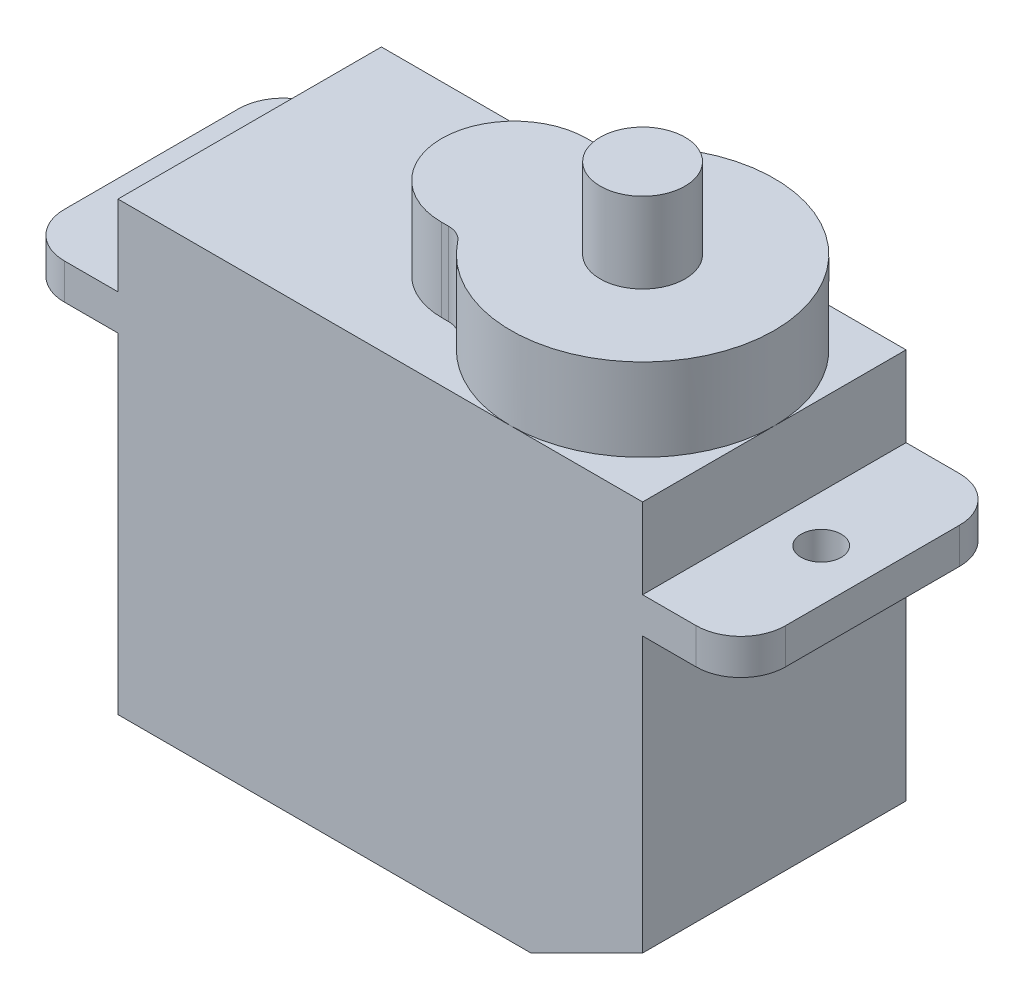
ISO-10303-21;
HEADER;
FILE_DESCRIPTION(('STEP AP214'),'2;1');
FILE_NAME('part.step','',(''),(''),'','','');
FILE_SCHEMA(('AUTOMOTIVE_DESIGN { 1 0 10303 214 1 1 1 1 }'));
ENDSEC;
DATA;
#1=APPLICATION_CONTEXT('core data for automotive mechanical design processes');
#2=APPLICATION_PROTOCOL_DEFINITION('international standard','automotive_design',2000,#1);
#3=PRODUCT_CONTEXT('',#1,'mechanical');
#4=PRODUCT('Part','Part','',(#3));
#5=PRODUCT_RELATED_PRODUCT_CATEGORY('part','',(#4));
#6=PRODUCT_DEFINITION_FORMATION('','',#4);
#7=PRODUCT_DEFINITION_CONTEXT('part definition',#1,'design');
#8=PRODUCT_DEFINITION('design','',#6,#7);
#9=PRODUCT_DEFINITION_SHAPE('','',#8);
#10=(LENGTH_UNIT() NAMED_UNIT(*) SI_UNIT(.MILLI.,.METRE.));
#11=(NAMED_UNIT(*) PLANE_ANGLE_UNIT() SI_UNIT($,.RADIAN.));
#12=(NAMED_UNIT(*) SI_UNIT($,.STERADIAN.) SOLID_ANGLE_UNIT());
#13=UNCERTAINTY_MEASURE_WITH_UNIT(LENGTH_MEASURE(1.E-05),#10,'distance_accuracy_value','');
#14=(GEOMETRIC_REPRESENTATION_CONTEXT(3) GLOBAL_UNCERTAINTY_ASSIGNED_CONTEXT((#13)) GLOBAL_UNIT_ASSIGNED_CONTEXT((#10,
#11,#12)) REPRESENTATION_CONTEXT('',''));
#15=CARTESIAN_POINT('',(0.,0.,0.));
#16=DIRECTION('',(0.,0.,1.));
#17=DIRECTION('',(1.,0.,0.));
#18=AXIS2_PLACEMENT_3D('',#15,#16,#17);
#19=CARTESIAN_POINT('',(0.,20.,11.8));
#20=DIRECTION('',(0.,1.,0.));
#21=DIRECTION('',(0.,0.,1.));
#22=AXIS2_PLACEMENT_3D('',#19,#20,#21);
#23=PLANE('',#22);
#24=CARTESIAN_POINT('',(12.1642387837581,20.,10.15));
#25=DIRECTION('',(0.,-1.,0.));
#26=DIRECTION('',(0.,0.,1.));
#27=AXIS2_PLACEMENT_3D('',#24,#25,#26);
#28=CIRCLE('',#27,1.);
#29=CARTESIAN_POINT('',(12.1642387837581,20.,9.15));
#30=VERTEX_POINT('',#29);
#31=CARTESIAN_POINT('',(12.9520302643728,20.,9.53405797101449));
#32=VERTEX_POINT('',#31);
#33=EDGE_CURVE('E52',#30,#32,#28,.T.);
#34=ORIENTED_EDGE('',*,*,#33,.F.);
#35=DIRECTION('',(1.,0.,0.));
#36=VECTOR('',#35,1.);
#37=CARTESIAN_POINT('',(11.85,20.,9.15));
#38=LINE('',#37,#36);
#39=CARTESIAN_POINT('',(11.85,20.,9.15));
#40=VERTEX_POINT('',#39);
#41=EDGE_CURVE('E56',#40,#30,#38,.T.);
#42=ORIENTED_EDGE('',*,*,#41,.F.);
#43=CARTESIAN_POINT('',(11.85,20.,5.9));
#44=DIRECTION('',(0.,1.,0.));
#45=DIRECTION('',(0.,0.,1.));
#46=AXIS2_PLACEMENT_3D('',#43,#44,#45);
#47=CIRCLE('',#46,3.25);
#48=CARTESIAN_POINT('',(11.85,20.,2.65));
#49=VERTEX_POINT('',#48);
#50=EDGE_CURVE('E743',#49,#40,#47,.T.);
#51=ORIENTED_EDGE('',*,*,#50,.F.);
#52=DIRECTION('',(-1.,0.,0.));
#53=VECTOR('',#52,1.);
#54=CARTESIAN_POINT('',(11.85,20.,2.65));
#55=LINE('',#54,#53);
#56=CARTESIAN_POINT('',(12.1642387837581,20.,2.65));
#57=VERTEX_POINT('',#56);
#58=EDGE_CURVE('E380',#57,#49,#55,.T.);
#59=ORIENTED_EDGE('',*,*,#58,.F.);
#60=CARTESIAN_POINT('',(12.1642387837581,20.,1.65));
#61=DIRECTION('',(0.,-1.,0.));
#62=DIRECTION('',(0.,0.,-1.));
#63=AXIS2_PLACEMENT_3D('',#60,#61,#62);
#64=CIRCLE('',#63,0.999999999999999);
#65=CARTESIAN_POINT('',(12.9520302643728,20.,2.26594202898551));
#66=VERTEX_POINT('',#65);
#67=EDGE_CURVE('E378',#66,#57,#64,.T.);
#68=ORIENTED_EDGE('',*,*,#67,.F.);
#69=CARTESIAN_POINT('',(17.6,20.,5.9));
#70=DIRECTION('',(0.,1.,0.));
#71=DIRECTION('',(0.,0.,1.));
#72=AXIS2_PLACEMENT_3D('',#69,#70,#71);
#73=CIRCLE('',#72,5.9);
#74=CARTESIAN_POINT('',(17.6,20.,0.));
#75=VERTEX_POINT('',#74);
#76=EDGE_CURVE('E372',#75,#66,#73,.T.);
#77=ORIENTED_EDGE('',*,*,#76,.F.);
#78=DIRECTION('',(1.,0.,0.));
#79=VECTOR('',#78,1.);
#80=CARTESIAN_POINT('',(0.,20.,0.));
#81=LINE('',#80,#79);
#82=CARTESIAN_POINT('',(0.,20.,0.));
#83=VERTEX_POINT('',#82);
#84=EDGE_CURVE('E277',#83,#75,#81,.T.);
#85=ORIENTED_EDGE('',*,*,#84,.F.);
#86=DIRECTION('',(0.,0.,-1.));
#87=VECTOR('',#86,1.);
#88=CARTESIAN_POINT('',(0.,20.,11.8));
#89=LINE('',#88,#87);
#90=CARTESIAN_POINT('',(0.,20.,11.8));
#91=VERTEX_POINT('',#90);
#92=EDGE_CURVE('E332',#91,#83,#89,.T.);
#93=ORIENTED_EDGE('',*,*,#92,.F.);
#94=DIRECTION('',(1.,0.,0.));
#95=VECTOR('',#94,1.);
#96=CARTESIAN_POINT('',(0.,20.,11.8));
#97=LINE('',#96,#95);
#98=CARTESIAN_POINT('',(17.6,20.,11.8));
#99=VERTEX_POINT('',#98);
#100=EDGE_CURVE('E244',#91,#99,#97,.T.);
#101=ORIENTED_EDGE('',*,*,#100,.T.);
#102=EDGE_CURVE('E45',#32,#99,#73,.T.);
#103=ORIENTED_EDGE('',*,*,#102,.F.);
#104=EDGE_LOOP('',(#34,#42,#51,#59,#68,#77,#85,#93,#101,#103));
#105=FACE_BOUND('',#104,.T.);
#106=ADVANCED_FACE('F34',(#105),#23,.T.);
#107=CARTESIAN_POINT('',(23.5,20.,5.9));
#108=VERTEX_POINT('',#107);
#109=EDGE_CURVE('E11',#99,#108,#73,.T.);
#110=ORIENTED_EDGE('',*,*,#109,.F.);
#111=CARTESIAN_POINT('',(23.5,20.,11.8));
#112=VERTEX_POINT('',#111);
#113=EDGE_CURVE('E243',#99,#112,#97,.T.);
#114=ORIENTED_EDGE('',*,*,#113,.T.);
#115=DIRECTION('',(0.,0.,-1.));
#116=VECTOR('',#115,1.);
#117=CARTESIAN_POINT('',(23.5,20.,11.8));
#118=LINE('',#117,#116);
#119=EDGE_CURVE('E328',#112,#108,#118,.T.);
#120=ORIENTED_EDGE('',*,*,#119,.T.);
#121=EDGE_LOOP('',(#110,#114,#120));
#122=FACE_BOUND('',#121,.T.);
#123=ADVANCED_FACE('F412',(#122),#23,.T.);
#124=CARTESIAN_POINT('',(-4.4,16.4,11.8));
#125=DIRECTION('',(0.,1.,0.));
#126=DIRECTION('',(0.,0.,1.));
#127=AXIS2_PLACEMENT_3D('',#124,#125,#126);
#128=PLANE('',#127);
#129=CARTESIAN_POINT('',(-2.1,16.4,5.9));
#130=DIRECTION('',(0.,1.,0.));
#131=DIRECTION('',(-1.,0.,0.));
#132=AXIS2_PLACEMENT_3D('',#129,#130,#131);
#133=CIRCLE('',#132,0.9);
#134=CARTESIAN_POINT('',(-3.,16.4,5.9));
#135=VERTEX_POINT('',#134);
#136=EDGE_CURVE('E233',#135,#135,#133,.T.);
#137=ORIENTED_EDGE('',*,*,#136,.F.);
#138=EDGE_LOOP('',(#137));
#139=FACE_BOUND('',#138,.T.);
#140=DIRECTION('',(0.,0.,-1.));
#141=VECTOR('',#140,1.);
#142=CARTESIAN_POINT('',(-4.4,16.4,11.8));
#143=LINE('',#142,#141);
#144=CARTESIAN_POINT('',(-4.4,16.4,9.8));
#145=VERTEX_POINT('',#144);
#146=CARTESIAN_POINT('',(-4.4,16.4,2.));
#147=VERTEX_POINT('',#146);
#148=EDGE_CURVE('E302',#145,#147,#143,.T.);
#149=ORIENTED_EDGE('',*,*,#148,.F.);
#150=CARTESIAN_POINT('',(-2.4,16.4,9.8));
#151=DIRECTION('',(0.,1.,0.));
#152=DIRECTION('',(0.,0.,1.));
#153=AXIS2_PLACEMENT_3D('',#150,#151,#152);
#154=CIRCLE('',#153,2.);
#155=CARTESIAN_POINT('',(-2.4,16.4,11.8));
#156=VERTEX_POINT('',#155);
#157=EDGE_CURVE('E367',#145,#156,#154,.T.);
#158=ORIENTED_EDGE('',*,*,#157,.T.);
#159=DIRECTION('',(1.,0.,0.));
#160=VECTOR('',#159,1.);
#161=CARTESIAN_POINT('',(-4.4,16.4,11.8));
#162=LINE('',#161,#160);
#163=CARTESIAN_POINT('',(0.,16.4,11.8));
#164=VERTEX_POINT('',#163);
#165=EDGE_CURVE('E237',#156,#164,#162,.T.);
#166=ORIENTED_EDGE('',*,*,#165,.T.);
#167=DIRECTION('',(0.,0.,-1.));
#168=VECTOR('',#167,1.);
#169=CARTESIAN_POINT('',(0.,16.4,11.8));
#170=LINE('',#169,#168);
#171=CARTESIAN_POINT('',(0.,16.4,0.));
#172=VERTEX_POINT('',#171);
#173=EDGE_CURVE('E270',#164,#172,#170,.T.);
#174=ORIENTED_EDGE('',*,*,#173,.T.);
#175=DIRECTION('',(1.,0.,0.));
#176=VECTOR('',#175,1.);
#177=CARTESIAN_POINT('',(-4.4,16.4,0.));
#178=LINE('',#177,#176);
#179=CARTESIAN_POINT('',(-2.4,16.4,0.));
#180=VERTEX_POINT('',#179);
#181=EDGE_CURVE('E271',#180,#172,#178,.T.);
#182=ORIENTED_EDGE('',*,*,#181,.F.);
#183=CARTESIAN_POINT('',(-2.4,16.4,2.));
#184=DIRECTION('',(0.,1.,0.));
#185=DIRECTION('',(0.,0.,1.));
#186=AXIS2_PLACEMENT_3D('',#183,#184,#185);
#187=CIRCLE('',#186,2.);
#188=EDGE_CURVE('E365',#180,#147,#187,.T.);
#189=ORIENTED_EDGE('',*,*,#188,.T.);
#190=EDGE_LOOP('',(#149,#158,#166,#174,#182,#189));
#191=FACE_BOUND('',#190,.T.);
#192=ADVANCED_FACE('F418',(#139,#191),#128,.T.);
#193=CARTESIAN_POINT('',(-4.4,14.8,11.8));
#194=DIRECTION('',(-1.,0.,0.));
#195=DIRECTION('',(0.,0.,1.));
#196=AXIS2_PLACEMENT_3D('',#193,#194,#195);
#197=PLANE('',#196);
#198=DIRECTION('',(0.,0.,-1.));
#199=VECTOR('',#198,1.);
#200=CARTESIAN_POINT('',(-4.4,14.8,11.8));
#201=LINE('',#200,#199);
#202=CARTESIAN_POINT('',(-4.4,14.8,9.8));
#203=VERTEX_POINT('',#202);
#204=CARTESIAN_POINT('',(-4.4,14.8,2.));
#205=VERTEX_POINT('',#204);
#206=EDGE_CURVE('E306',#203,#205,#201,.T.);
#207=ORIENTED_EDGE('',*,*,#206,.F.);
#208=DIRECTION('',(0.,1.,0.));
#209=VECTOR('',#208,1.);
#210=CARTESIAN_POINT('',(-4.4,14.8,9.8));
#211=LINE('',#210,#209);
#212=EDGE_CURVE('E362',#203,#145,#211,.T.);
#213=ORIENTED_EDGE('',*,*,#212,.T.);
#214=ORIENTED_EDGE('',*,*,#148,.T.);
#215=DIRECTION('',(0.,1.,0.));
#216=VECTOR('',#215,1.);
#217=CARTESIAN_POINT('',(-4.4,14.8,2.));
#218=LINE('',#217,#216);
#219=EDGE_CURVE('E360',#147,#205,#218,.F.);
#220=ORIENTED_EDGE('',*,*,#219,.T.);
#221=EDGE_LOOP('',(#207,#213,#214,#220));
#222=FACE_BOUND('',#221,.T.);
#223=ADVANCED_FACE('F458',(#222),#197,.T.);
#224=CARTESIAN_POINT('',(0.,14.8,11.8));
#225=DIRECTION('',(0.,-1.,0.));
#226=DIRECTION('',(0.,0.,-1.));
#227=AXIS2_PLACEMENT_3D('',#224,#225,#226);
#228=PLANE('',#227);
#229=CARTESIAN_POINT('',(-2.1,14.8,5.9));
#230=DIRECTION('',(0.,-1.,0.));
#231=DIRECTION('',(0.,0.,-1.));
#232=AXIS2_PLACEMENT_3D('',#229,#230,#231);
#233=CIRCLE('',#232,0.9);
#234=CARTESIAN_POINT('',(-2.1,14.8,5.00000000000001));
#235=VERTEX_POINT('',#234);
#236=EDGE_CURVE('E236',#235,#235,#233,.T.);
#237=ORIENTED_EDGE('',*,*,#236,.F.);
#238=EDGE_LOOP('',(#237));
#239=FACE_BOUND('',#238,.T.);
#240=DIRECTION('',(-1.,0.,0.));
#241=VECTOR('',#240,1.);
#242=CARTESIAN_POINT('',(0.,14.8,11.8));
#243=LINE('',#242,#241);
#244=CARTESIAN_POINT('',(0.,14.8,11.8));
#245=VERTEX_POINT('',#244);
#246=CARTESIAN_POINT('',(-2.4,14.8,11.8));
#247=VERTEX_POINT('',#246);
#248=EDGE_CURVE('E267',#245,#247,#243,.T.);
#249=ORIENTED_EDGE('',*,*,#248,.T.);
#250=CARTESIAN_POINT('',(-2.4,14.8,9.8));
#251=DIRECTION('',(0.,-1.,0.));
#252=DIRECTION('',(0.,0.,-1.));
#253=AXIS2_PLACEMENT_3D('',#250,#251,#252);
#254=CIRCLE('',#253,2.);
#255=EDGE_CURVE('E38',#247,#203,#254,.T.);
#256=ORIENTED_EDGE('',*,*,#255,.T.);
#257=ORIENTED_EDGE('',*,*,#206,.T.);
#258=CARTESIAN_POINT('',(-2.4,14.8,2.));
#259=DIRECTION('',(0.,-1.,0.));
#260=DIRECTION('',(0.,0.,-1.));
#261=AXIS2_PLACEMENT_3D('',#258,#259,#260);
#262=CIRCLE('',#261,2.);
#263=CARTESIAN_POINT('',(-2.4,14.8,0.));
#264=VERTEX_POINT('',#263);
#265=EDGE_CURVE('E368',#205,#264,#262,.T.);
#266=ORIENTED_EDGE('',*,*,#265,.T.);
#267=DIRECTION('',(-1.,0.,0.));
#268=VECTOR('',#267,1.);
#269=CARTESIAN_POINT('',(0.,14.8,0.));
#270=LINE('',#269,#268);
#271=CARTESIAN_POINT('',(0.,14.8,0.));
#272=VERTEX_POINT('',#271);
#273=EDGE_CURVE('E240',#272,#264,#270,.T.);
#274=ORIENTED_EDGE('',*,*,#273,.F.);
#275=DIRECTION('',(0.,0.,-1.));
#276=VECTOR('',#275,1.);
#277=CARTESIAN_POINT('',(0.,14.8,11.8));
#278=LINE('',#277,#276);
#279=EDGE_CURVE('E309',#245,#272,#278,.T.);
#280=ORIENTED_EDGE('',*,*,#279,.F.);
#281=EDGE_LOOP('',(#249,#256,#257,#266,#274,#280));
#282=FACE_BOUND('',#281,.T.);
#283=ADVANCED_FACE('F466',(#239,#282),#228,.T.);
#284=CARTESIAN_POINT('',(0.,0.,11.8));
#285=DIRECTION('',(-1.,0.,0.));
#286=DIRECTION('',(0.,0.,1.));
#287=AXIS2_PLACEMENT_3D('',#284,#285,#286);
#288=PLANE('',#287);
#289=DIRECTION('',(0.,1.,0.));
#290=VECTOR('',#289,1.);
#291=CARTESIAN_POINT('',(0.,0.,0.));
#292=LINE('',#291,#290);
#293=CARTESIAN_POINT('',(0.,0.,0.));
#294=VERTEX_POINT('',#293);
#295=EDGE_CURVE('E297',#294,#272,#292,.T.);
#296=ORIENTED_EDGE('',*,*,#295,.F.);
#297=DIRECTION('',(0.,0.,-1.));
#298=VECTOR('',#297,1.);
#299=CARTESIAN_POINT('',(0.,0.,11.8));
#300=LINE('',#299,#298);
#301=CARTESIAN_POINT('',(0.,0.,11.8));
#302=VERTEX_POINT('',#301);
#303=EDGE_CURVE('E311',#302,#294,#300,.T.);
#304=ORIENTED_EDGE('',*,*,#303,.F.);
#305=DIRECTION('',(0.,1.,0.));
#306=VECTOR('',#305,1.);
#307=CARTESIAN_POINT('',(0.,0.,11.8));
#308=LINE('',#307,#306);
#309=EDGE_CURVE('E264',#302,#245,#308,.T.);
#310=ORIENTED_EDGE('',*,*,#309,.T.);
#311=ORIENTED_EDGE('',*,*,#279,.T.);
#312=EDGE_LOOP('',(#296,#304,#310,#311));
#313=FACE_BOUND('',#312,.T.);
#314=ADVANCED_FACE('F470',(#313),#288,.T.);
#315=CARTESIAN_POINT('',(18.5,0.,11.8));
#316=DIRECTION('',(0.,-1.,0.));
#317=DIRECTION('',(0.,0.,-1.));
#318=AXIS2_PLACEMENT_3D('',#315,#316,#317);
#319=PLANE('',#318);
#320=DIRECTION('',(-1.,0.,0.));
#321=VECTOR('',#320,1.);
#322=CARTESIAN_POINT('',(18.5,0.,0.));
#323=LINE('',#322,#321);
#324=CARTESIAN_POINT('',(18.5,0.,0.));
#325=VERTEX_POINT('',#324);
#326=EDGE_CURVE('E294',#325,#294,#323,.T.);
#327=ORIENTED_EDGE('',*,*,#326,.F.);
#328=DIRECTION('',(0.,0.,-1.));
#329=VECTOR('',#328,1.);
#330=CARTESIAN_POINT('',(18.5,0.,11.8));
#331=LINE('',#330,#329);
#332=CARTESIAN_POINT('',(18.5,0.,11.8));
#333=VERTEX_POINT('',#332);
#334=EDGE_CURVE('E313',#333,#325,#331,.T.);
#335=ORIENTED_EDGE('',*,*,#334,.F.);
#336=DIRECTION('',(-1.,0.,0.));
#337=VECTOR('',#336,1.);
#338=CARTESIAN_POINT('',(18.5,0.,11.8));
#339=LINE('',#338,#337);
#340=EDGE_CURVE('E261',#333,#302,#339,.T.);
#341=ORIENTED_EDGE('',*,*,#340,.T.);
#342=ORIENTED_EDGE('',*,*,#303,.T.);
#343=EDGE_LOOP('',(#327,#335,#341,#342));
#344=FACE_BOUND('',#343,.T.);
#345=ADVANCED_FACE('F473',(#344),#319,.T.);
#346=CARTESIAN_POINT('',(23.5,2.5,11.8));
#347=DIRECTION('',(0.447213595499958,-0.894427190999916,0.));
#348=DIRECTION('',(0.894427190999916,0.447213595499958,0.));
#349=AXIS2_PLACEMENT_3D('',#346,#347,#348);
#350=PLANE('',#349);
#351=DIRECTION('',(-0.894427190999916,-0.447213595499958,0.));
#352=VECTOR('',#351,1.);
#353=CARTESIAN_POINT('',(23.5,2.5,0.));
#354=LINE('',#353,#352);
#355=CARTESIAN_POINT('',(23.5,2.5,0.));
#356=VERTEX_POINT('',#355);
#357=EDGE_CURVE('E291',#356,#325,#354,.T.);
#358=ORIENTED_EDGE('',*,*,#357,.F.);
#359=DIRECTION('',(0.,0.,-1.));
#360=VECTOR('',#359,1.);
#361=CARTESIAN_POINT('',(23.5,2.5,11.8));
#362=LINE('',#361,#360);
#363=CARTESIAN_POINT('',(23.5,2.5,11.8));
#364=VERTEX_POINT('',#363);
#365=EDGE_CURVE('E315',#364,#356,#362,.T.);
#366=ORIENTED_EDGE('',*,*,#365,.F.);
#367=DIRECTION('',(-0.894427190999916,-0.447213595499958,0.));
#368=VECTOR('',#367,1.);
#369=CARTESIAN_POINT('',(23.5,2.5,11.8));
#370=LINE('',#369,#368);
#371=EDGE_CURVE('E258',#364,#333,#370,.T.);
#372=ORIENTED_EDGE('',*,*,#371,.T.);
#373=ORIENTED_EDGE('',*,*,#334,.T.);
#374=EDGE_LOOP('',(#358,#366,#372,#373));
#375=FACE_BOUND('',#374,.T.);
#376=ADVANCED_FACE('F478',(#375),#350,.T.);
#377=CARTESIAN_POINT('',(23.5,14.8,11.8));
#378=DIRECTION('',(1.,0.,0.));
#379=DIRECTION('',(0.,1.,0.));
#380=AXIS2_PLACEMENT_3D('',#377,#378,#379);
#381=PLANE('',#380);
#382=DIRECTION('',(0.,-1.,0.));
#383=VECTOR('',#382,1.);
#384=CARTESIAN_POINT('',(23.5,14.8,0.));
#385=LINE('',#384,#383);
#386=CARTESIAN_POINT('',(23.5,14.8,0.));
#387=VERTEX_POINT('',#386);
#388=EDGE_CURVE('E288',#387,#356,#385,.T.);
#389=ORIENTED_EDGE('',*,*,#388,.F.);
#390=DIRECTION('',(0.,0.,-1.));
#391=VECTOR('',#390,1.);
#392=CARTESIAN_POINT('',(23.5,14.8,11.8));
#393=LINE('',#392,#391);
#394=CARTESIAN_POINT('',(23.5,14.8,11.8));
#395=VERTEX_POINT('',#394);
#396=EDGE_CURVE('E317',#395,#387,#393,.T.);
#397=ORIENTED_EDGE('',*,*,#396,.F.);
#398=DIRECTION('',(0.,-1.,0.));
#399=VECTOR('',#398,1.);
#400=CARTESIAN_POINT('',(23.5,14.8,11.8));
#401=LINE('',#400,#399);
#402=EDGE_CURVE('E255',#395,#364,#401,.T.);
#403=ORIENTED_EDGE('',*,*,#402,.T.);
#404=ORIENTED_EDGE('',*,*,#365,.T.);
#405=EDGE_LOOP('',(#389,#397,#403,#404));
#406=FACE_BOUND('',#405,.T.);
#407=ADVANCED_FACE('F481',(#406),#381,.T.);
#408=CARTESIAN_POINT('',(27.9,14.8,11.8));
#409=DIRECTION('',(0.,-1.,0.));
#410=DIRECTION('',(0.,0.,-1.));
#411=AXIS2_PLACEMENT_3D('',#408,#409,#410);
#412=PLANE('',#411);
#413=CARTESIAN_POINT('',(25.6,14.8,5.9));
#414=DIRECTION('',(0.,-1.,0.));
#415=DIRECTION('',(0.,0.,-1.));
#416=AXIS2_PLACEMENT_3D('',#413,#414,#415);
#417=CIRCLE('',#416,0.9);
#418=CARTESIAN_POINT('',(25.6,14.8,5.));
#419=VERTEX_POINT('',#418);
#420=EDGE_CURVE('E225',#419,#419,#417,.T.);
#421=ORIENTED_EDGE('',*,*,#420,.F.);
#422=EDGE_LOOP('',(#421));
#423=FACE_BOUND('',#422,.T.);
#424=DIRECTION('',(0.,0.,-1.));
#425=VECTOR('',#424,1.);
#426=CARTESIAN_POINT('',(27.9,14.8,11.8));
#427=LINE('',#426,#425);
#428=CARTESIAN_POINT('',(27.9,14.8,9.8));
#429=VERTEX_POINT('',#428);
#430=CARTESIAN_POINT('',(27.9,14.8,2.));
#431=VERTEX_POINT('',#430);
#432=EDGE_CURVE('E320',#429,#431,#427,.T.);
#433=ORIENTED_EDGE('',*,*,#432,.F.);
#434=CARTESIAN_POINT('',(25.9,14.8,9.8));
#435=DIRECTION('',(0.,-1.,0.));
#436=DIRECTION('',(0.,0.,-1.));
#437=AXIS2_PLACEMENT_3D('',#434,#435,#436);
#438=CIRCLE('',#437,2.);
#439=CARTESIAN_POINT('',(25.9,14.8,11.8));
#440=VERTEX_POINT('',#439);
#441=EDGE_CURVE('E344',#429,#440,#438,.T.);
#442=ORIENTED_EDGE('',*,*,#441,.T.);
#443=DIRECTION('',(-1.,0.,0.));
#444=VECTOR('',#443,1.);
#445=CARTESIAN_POINT('',(27.9,14.8,11.8));
#446=LINE('',#445,#444);
#447=EDGE_CURVE('E253',#440,#395,#446,.T.);
#448=ORIENTED_EDGE('',*,*,#447,.T.);
#449=ORIENTED_EDGE('',*,*,#396,.T.);
#450=DIRECTION('',(-1.,0.,0.));
#451=VECTOR('',#450,1.);
#452=CARTESIAN_POINT('',(27.9,14.8,0.));
#453=LINE('',#452,#451);
#454=CARTESIAN_POINT('',(25.9,14.8,0.));
#455=VERTEX_POINT('',#454);
#456=EDGE_CURVE('E286',#455,#387,#453,.T.);
#457=ORIENTED_EDGE('',*,*,#456,.F.);
#458=CARTESIAN_POINT('',(25.9,14.8,2.));
#459=DIRECTION('',(0.,-1.,0.));
#460=DIRECTION('',(0.,0.,-1.));
#461=AXIS2_PLACEMENT_3D('',#458,#459,#460);
#462=CIRCLE('',#461,2.);
#463=EDGE_CURVE('E342',#455,#431,#462,.T.);
#464=ORIENTED_EDGE('',*,*,#463,.T.);
#465=EDGE_LOOP('',(#433,#442,#448,#449,#457,#464));
#466=FACE_BOUND('',#465,.T.);
#467=ADVANCED_FACE('F501',(#423,#466),#412,.T.);
#468=CARTESIAN_POINT('',(27.9,16.4,11.8));
#469=DIRECTION('',(1.,0.,0.));
#470=DIRECTION('',(0.,0.,-1.));
#471=AXIS2_PLACEMENT_3D('',#468,#469,#470);
#472=PLANE('',#471);
#473=DIRECTION('',(0.,0.,-1.));
#474=VECTOR('',#473,1.);
#475=CARTESIAN_POINT('',(27.9,16.4,11.8));
#476=LINE('',#475,#474);
#477=CARTESIAN_POINT('',(27.9,16.4,9.8));
#478=VERTEX_POINT('',#477);
#479=CARTESIAN_POINT('',(27.9,16.4,2.));
#480=VERTEX_POINT('',#479);
#481=EDGE_CURVE('E323',#478,#480,#476,.T.);
#482=ORIENTED_EDGE('',*,*,#481,.F.);
#483=DIRECTION('',(0.,-1.,0.));
#484=VECTOR('',#483,1.);
#485=CARTESIAN_POINT('',(27.9,16.4,9.8));
#486=LINE('',#485,#484);
#487=EDGE_CURVE('E339',#478,#429,#486,.T.);
#488=ORIENTED_EDGE('',*,*,#487,.T.);
#489=ORIENTED_EDGE('',*,*,#432,.T.);
#490=DIRECTION('',(0.,-1.,0.));
#491=VECTOR('',#490,1.);
#492=CARTESIAN_POINT('',(27.9,16.4,2.));
#493=LINE('',#492,#491);
#494=EDGE_CURVE('E305',#431,#480,#493,.F.);
#495=ORIENTED_EDGE('',*,*,#494,.T.);
#496=EDGE_LOOP('',(#482,#488,#489,#495));
#497=FACE_BOUND('',#496,.T.);
#498=ADVANCED_FACE('F493',(#497),#472,.T.);
#499=CARTESIAN_POINT('',(23.5,16.4,11.8));
#500=DIRECTION('',(0.,1.,0.));
#501=DIRECTION('',(-1.,0.,0.));
#502=AXIS2_PLACEMENT_3D('',#499,#500,#501);
#503=PLANE('',#502);
#504=CARTESIAN_POINT('',(25.6,16.4,5.9));
#505=DIRECTION('',(0.,1.,0.));
#506=DIRECTION('',(-1.,0.,0.));
#507=AXIS2_PLACEMENT_3D('',#504,#505,#506);
#508=CIRCLE('',#507,0.9);
#509=CARTESIAN_POINT('',(24.7,16.4,5.9));
#510=VERTEX_POINT('',#509);
#511=EDGE_CURVE('E222',#510,#510,#508,.T.);
#512=ORIENTED_EDGE('',*,*,#511,.F.);
#513=EDGE_LOOP('',(#512));
#514=FACE_BOUND('',#513,.T.);
#515=DIRECTION('',(1.,0.,0.));
#516=VECTOR('',#515,1.);
#517=CARTESIAN_POINT('',(23.5,16.4,11.8));
#518=LINE('',#517,#516);
#519=CARTESIAN_POINT('',(23.5,16.4,11.8));
#520=VERTEX_POINT('',#519);
#521=CARTESIAN_POINT('',(25.9,16.4,11.8));
#522=VERTEX_POINT('',#521);
#523=EDGE_CURVE('E250',#520,#522,#518,.T.);
#524=ORIENTED_EDGE('',*,*,#523,.T.);
#525=CARTESIAN_POINT('',(25.9,16.4,9.8));
#526=DIRECTION('',(0.,1.,0.));
#527=DIRECTION('',(-1.,0.,0.));
#528=AXIS2_PLACEMENT_3D('',#525,#526,#527);
#529=CIRCLE('',#528,2.);
#530=EDGE_CURVE('E352',#522,#478,#529,.T.);
#531=ORIENTED_EDGE('',*,*,#530,.T.);
#532=ORIENTED_EDGE('',*,*,#481,.T.);
#533=CARTESIAN_POINT('',(25.9,16.4,2.));
#534=DIRECTION('',(0.,1.,0.));
#535=DIRECTION('',(-1.,0.,0.));
#536=AXIS2_PLACEMENT_3D('',#533,#534,#535);
#537=CIRCLE('',#536,2.);
#538=CARTESIAN_POINT('',(25.9,16.4,0.));
#539=VERTEX_POINT('',#538);
#540=EDGE_CURVE('E350',#480,#539,#537,.T.);
#541=ORIENTED_EDGE('',*,*,#540,.T.);
#542=DIRECTION('',(1.,0.,0.));
#543=VECTOR('',#542,1.);
#544=CARTESIAN_POINT('',(23.5,16.4,0.));
#545=LINE('',#544,#543);
#546=CARTESIAN_POINT('',(23.5,16.4,0.));
#547=VERTEX_POINT('',#546);
#548=EDGE_CURVE('E283',#547,#539,#545,.T.);
#549=ORIENTED_EDGE('',*,*,#548,.F.);
#550=DIRECTION('',(0.,0.,-1.));
#551=VECTOR('',#550,1.);
#552=CARTESIAN_POINT('',(23.5,16.4,11.8));
#553=LINE('',#552,#551);
#554=EDGE_CURVE('E326',#520,#547,#553,.T.);
#555=ORIENTED_EDGE('',*,*,#554,.F.);
#556=EDGE_LOOP('',(#524,#531,#532,#541,#549,#555));
#557=FACE_BOUND('',#556,.T.);
#558=ADVANCED_FACE('F432',(#514,#557),#503,.T.);
#559=CARTESIAN_POINT('',(23.5,20.,11.8));
#560=DIRECTION('',(1.,0.,0.));
#561=DIRECTION('',(0.,0.,-1.));
#562=AXIS2_PLACEMENT_3D('',#559,#560,#561);
#563=PLANE('',#562);
#564=DIRECTION('',(0.,-1.,0.));
#565=VECTOR('',#564,1.);
#566=CARTESIAN_POINT('',(23.5,20.,0.));
#567=LINE('',#566,#565);
#568=CARTESIAN_POINT('',(23.5,20.,0.));
#569=VERTEX_POINT('',#568);
#570=EDGE_CURVE('E280',#569,#547,#567,.T.);
#571=ORIENTED_EDGE('',*,*,#570,.F.);
#572=EDGE_CURVE('E331',#108,#569,#118,.T.);
#573=ORIENTED_EDGE('',*,*,#572,.F.);
#574=ORIENTED_EDGE('',*,*,#119,.F.);
#575=DIRECTION('',(0.,-1.,0.));
#576=VECTOR('',#575,1.);
#577=CARTESIAN_POINT('',(23.5,20.,11.8));
#578=LINE('',#577,#576);
#579=EDGE_CURVE('E247',#112,#520,#578,.T.);
#580=ORIENTED_EDGE('',*,*,#579,.T.);
#581=ORIENTED_EDGE('',*,*,#554,.T.);
#582=EDGE_LOOP('',(#571,#573,#574,#580,#581));
#583=FACE_BOUND('',#582,.T.);
#584=ADVANCED_FACE('F424',(#583),#563,.T.);
#585=EDGE_CURVE('E43',#108,#75,#73,.T.);
#586=ORIENTED_EDGE('',*,*,#585,.F.);
#587=ORIENTED_EDGE('',*,*,#572,.T.);
#588=EDGE_CURVE('E276',#75,#569,#81,.T.);
#589=ORIENTED_EDGE('',*,*,#588,.F.);
#590=EDGE_LOOP('',(#586,#587,#589));
#591=FACE_BOUND('',#590,.T.);
#592=ADVANCED_FACE('F414',(#591),#23,.T.);
#593=CARTESIAN_POINT('',(0.,16.4,11.8));
#594=DIRECTION('',(-1.,0.,0.));
#595=DIRECTION('',(0.,0.,1.));
#596=AXIS2_PLACEMENT_3D('',#593,#594,#595);
#597=PLANE('',#596);
#598=DIRECTION('',(0.,1.,0.));
#599=VECTOR('',#598,1.);
#600=CARTESIAN_POINT('',(0.,16.4,0.));
#601=LINE('',#600,#599);
#602=EDGE_CURVE('E273',#172,#83,#601,.T.);
#603=ORIENTED_EDGE('',*,*,#602,.F.);
#604=ORIENTED_EDGE('',*,*,#173,.F.);
#605=DIRECTION('',(0.,1.,0.));
#606=VECTOR('',#605,1.);
#607=CARTESIAN_POINT('',(0.,16.4,11.8));
#608=LINE('',#607,#606);
#609=EDGE_CURVE('E239',#164,#91,#608,.T.);
#610=ORIENTED_EDGE('',*,*,#609,.T.);
#611=ORIENTED_EDGE('',*,*,#92,.T.);
#612=EDGE_LOOP('',(#603,#604,#610,#611));
#613=FACE_BOUND('',#612,.T.);
#614=ADVANCED_FACE('F423',(#613),#597,.T.);
#615=CARTESIAN_POINT('',(0.,0.,11.8));
#616=DIRECTION('',(0.,0.,1.));
#617=DIRECTION('',(1.,0.,0.));
#618=AXIS2_PLACEMENT_3D('',#615,#616,#617);
#619=PLANE('',#618);
#620=ORIENTED_EDGE('',*,*,#447,.F.);
#621=DIRECTION('',(0.,-1.,0.));
#622=VECTOR('',#621,1.);
#623=CARTESIAN_POINT('',(25.9,0.,11.8));
#624=LINE('',#623,#622);
#625=EDGE_CURVE('E348',#440,#522,#624,.F.);
#626=ORIENTED_EDGE('',*,*,#625,.T.);
#627=ORIENTED_EDGE('',*,*,#523,.F.);
#628=ORIENTED_EDGE('',*,*,#579,.F.);
#629=ORIENTED_EDGE('',*,*,#113,.F.);
#630=ORIENTED_EDGE('',*,*,#100,.F.);
#631=ORIENTED_EDGE('',*,*,#609,.F.);
#632=ORIENTED_EDGE('',*,*,#165,.F.);
#633=DIRECTION('',(0.,1.,0.));
#634=VECTOR('',#633,1.);
#635=CARTESIAN_POINT('',(-2.4,0.,11.8));
#636=LINE('',#635,#634);
#637=EDGE_CURVE('E346',#156,#247,#636,.F.);
#638=ORIENTED_EDGE('',*,*,#637,.T.);
#639=ORIENTED_EDGE('',*,*,#248,.F.);
#640=ORIENTED_EDGE('',*,*,#309,.F.);
#641=ORIENTED_EDGE('',*,*,#340,.F.);
#642=ORIENTED_EDGE('',*,*,#371,.F.);
#643=ORIENTED_EDGE('',*,*,#402,.F.);
#644=EDGE_LOOP('',(#620,#626,#627,#628,#629,#630,#631,#632,#638,#639,#640,#641,#642,#643));
#645=FACE_BOUND('',#644,.T.);
#646=ADVANCED_FACE('F430',(#645),#619,.T.);
#647=CARTESIAN_POINT('',(0.,0.,0.));
#648=DIRECTION('',(0.,0.,1.));
#649=DIRECTION('',(1.,0.,0.));
#650=AXIS2_PLACEMENT_3D('',#647,#648,#649);
#651=PLANE('',#650);
#652=ORIENTED_EDGE('',*,*,#548,.T.);
#653=DIRECTION('',(0.,-1.,0.));
#654=VECTOR('',#653,1.);
#655=CARTESIAN_POINT('',(25.9,14.8,0.));
#656=LINE('',#655,#654);
#657=EDGE_CURVE('E357',#539,#455,#656,.T.);
#658=ORIENTED_EDGE('',*,*,#657,.T.);
#659=ORIENTED_EDGE('',*,*,#456,.T.);
#660=ORIENTED_EDGE('',*,*,#388,.T.);
#661=ORIENTED_EDGE('',*,*,#357,.T.);
#662=ORIENTED_EDGE('',*,*,#326,.T.);
#663=ORIENTED_EDGE('',*,*,#295,.T.);
#664=ORIENTED_EDGE('',*,*,#273,.T.);
#665=DIRECTION('',(0.,1.,0.));
#666=VECTOR('',#665,1.);
#667=CARTESIAN_POINT('',(-2.4,16.4,0.));
#668=LINE('',#667,#666);
#669=EDGE_CURVE('E354',#264,#180,#668,.T.);
#670=ORIENTED_EDGE('',*,*,#669,.T.);
#671=ORIENTED_EDGE('',*,*,#181,.T.);
#672=ORIENTED_EDGE('',*,*,#602,.T.);
#673=ORIENTED_EDGE('',*,*,#84,.T.);
#674=ORIENTED_EDGE('',*,*,#588,.T.);
#675=ORIENTED_EDGE('',*,*,#570,.T.);
#676=EDGE_LOOP('',(#652,#658,#659,#660,#661,#662,#663,#664,#670,#671,#672,#673,#674,#675));
#677=FACE_BOUND('',#676,.T.);
#678=ADVANCED_FACE('F464',(#677),#651,.F.);
#679=CARTESIAN_POINT('',(-2.09999999999999,4.59999999999998,5.9));
#680=DIRECTION('',(0.,1.,0.));
#681=DIRECTION('',(-1.,0.,0.));
#682=AXIS2_PLACEMENT_3D('',#679,#680,#681);
#683=CYLINDRICAL_SURFACE('',#682,0.9);
#684=ORIENTED_EDGE('',*,*,#236,.T.);
#685=EDGE_LOOP('',(#684));
#686=FACE_BOUND('',#685,.T.);
#687=ORIENTED_EDGE('',*,*,#136,.T.);
#688=EDGE_LOOP('',(#687));
#689=FACE_BOUND('',#688,.T.);
#690=ADVANCED_FACE('F522',(#686,#689),#683,.F.);
#691=CARTESIAN_POINT('',(25.6,4.6,5.9));
#692=DIRECTION('',(0.,1.,0.));
#693=DIRECTION('',(-1.,0.,0.));
#694=AXIS2_PLACEMENT_3D('',#691,#692,#693);
#695=CYLINDRICAL_SURFACE('',#694,0.9);
#696=ORIENTED_EDGE('',*,*,#420,.T.);
#697=EDGE_LOOP('',(#696));
#698=FACE_BOUND('',#697,.T.);
#699=ORIENTED_EDGE('',*,*,#511,.T.);
#700=EDGE_LOOP('',(#699));
#701=FACE_BOUND('',#700,.T.);
#702=ADVANCED_FACE('F520',(#698,#701),#695,.F.);
#703=CARTESIAN_POINT('',(25.9,16.4,9.8));
#704=DIRECTION('',(0.,-1.,0.));
#705=DIRECTION('',(0.,0.,-1.));
#706=AXIS2_PLACEMENT_3D('',#703,#704,#705);
#707=CYLINDRICAL_SURFACE('',#706,2.);
#708=ORIENTED_EDGE('',*,*,#530,.F.);
#709=ORIENTED_EDGE('',*,*,#625,.F.);
#710=ORIENTED_EDGE('',*,*,#441,.F.);
#711=ORIENTED_EDGE('',*,*,#487,.F.);
#712=EDGE_LOOP('',(#708,#709,#710,#711));
#713=FACE_BOUND('',#712,.T.);
#714=ADVANCED_FACE('F487',(#713),#707,.T.);
#715=CARTESIAN_POINT('',(25.9,0.,2.));
#716=DIRECTION('',(0.,1.,0.));
#717=DIRECTION('',(0.,0.,1.));
#718=AXIS2_PLACEMENT_3D('',#715,#716,#717);
#719=CYLINDRICAL_SURFACE('',#718,2.);
#720=ORIENTED_EDGE('',*,*,#540,.F.);
#721=ORIENTED_EDGE('',*,*,#494,.F.);
#722=ORIENTED_EDGE('',*,*,#463,.F.);
#723=ORIENTED_EDGE('',*,*,#657,.F.);
#724=EDGE_LOOP('',(#720,#721,#722,#723));
#725=FACE_BOUND('',#724,.T.);
#726=ADVANCED_FACE('F497',(#725),#719,.T.);
#727=CARTESIAN_POINT('',(-2.4,14.8,9.8));
#728=DIRECTION('',(0.,1.,0.));
#729=DIRECTION('',(0.,0.,1.));
#730=AXIS2_PLACEMENT_3D('',#727,#728,#729);
#731=CYLINDRICAL_SURFACE('',#730,2.);
#732=ORIENTED_EDGE('',*,*,#255,.F.);
#733=ORIENTED_EDGE('',*,*,#637,.F.);
#734=ORIENTED_EDGE('',*,*,#157,.F.);
#735=ORIENTED_EDGE('',*,*,#212,.F.);
#736=EDGE_LOOP('',(#732,#733,#734,#735));
#737=FACE_BOUND('',#736,.T.);
#738=ADVANCED_FACE('F454',(#737),#731,.T.);
#739=CARTESIAN_POINT('',(-2.4,0.,2.));
#740=DIRECTION('',(0.,-1.,0.));
#741=DIRECTION('',(0.,0.,-1.));
#742=AXIS2_PLACEMENT_3D('',#739,#740,#741);
#743=CYLINDRICAL_SURFACE('',#742,2.);
#744=ORIENTED_EDGE('',*,*,#265,.F.);
#745=ORIENTED_EDGE('',*,*,#219,.F.);
#746=ORIENTED_EDGE('',*,*,#188,.F.);
#747=ORIENTED_EDGE('',*,*,#669,.F.);
#748=EDGE_LOOP('',(#744,#745,#746,#747));
#749=FACE_BOUND('',#748,.T.);
#750=ADVANCED_FACE('F36',(#749),#743,.T.);
#751=CARTESIAN_POINT('',(12.1642387837581,23.7,10.15));
#752=DIRECTION('',(0.,-1.,0.));
#753=DIRECTION('',(0.,0.,-1.));
#754=AXIS2_PLACEMENT_3D('',#751,#752,#753);
#755=CYLINDRICAL_SURFACE('',#754,1.);
#756=ORIENTED_EDGE('',*,*,#33,.T.);
#757=DIRECTION('',(0.,-1.,0.));
#758=VECTOR('',#757,1.);
#759=CARTESIAN_POINT('',(12.9520302643728,23.7,9.53405797101449));
#760=LINE('',#759,#758);
#761=CARTESIAN_POINT('',(12.9520302643728,23.7,9.53405797101449));
#762=VERTEX_POINT('',#761);
#763=EDGE_CURVE('E204',#762,#32,#760,.T.);
#764=ORIENTED_EDGE('',*,*,#763,.F.);
#765=CARTESIAN_POINT('',(12.1642387837581,23.7,10.15));
#766=DIRECTION('',(0.,-1.,0.));
#767=DIRECTION('',(0.,0.,1.));
#768=AXIS2_PLACEMENT_3D('',#765,#766,#767);
#769=CIRCLE('',#768,1.);
#770=CARTESIAN_POINT('',(12.1642387837581,23.7,9.15));
#771=VERTEX_POINT('',#770);
#772=EDGE_CURVE('E211',#771,#762,#769,.T.);
#773=ORIENTED_EDGE('',*,*,#772,.F.);
#774=DIRECTION('',(0.,-1.,0.));
#775=VECTOR('',#774,1.);
#776=CARTESIAN_POINT('',(12.1642387837581,23.7,9.15));
#777=LINE('',#776,#775);
#778=EDGE_CURVE('E387',#771,#30,#777,.T.);
#779=ORIENTED_EDGE('',*,*,#778,.T.);
#780=EDGE_LOOP('',(#756,#764,#773,#779));
#781=FACE_BOUND('',#780,.T.);
#782=ADVANCED_FACE('F221',(#781),#755,.F.);
#783=CARTESIAN_POINT('',(17.6,23.7,5.9));
#784=DIRECTION('',(0.,-1.,0.));
#785=DIRECTION('',(0.,0.,-1.));
#786=AXIS2_PLACEMENT_3D('',#783,#784,#785);
#787=CYLINDRICAL_SURFACE('',#786,5.9);
#788=ORIENTED_EDGE('',*,*,#102,.T.);
#789=ORIENTED_EDGE('',*,*,#109,.T.);
#790=ORIENTED_EDGE('',*,*,#585,.T.);
#791=ORIENTED_EDGE('',*,*,#76,.T.);
#792=DIRECTION('',(0.,-1.,0.));
#793=VECTOR('',#792,1.);
#794=CARTESIAN_POINT('',(12.9520302643728,23.7,2.26594202898551));
#795=LINE('',#794,#793);
#796=CARTESIAN_POINT('',(12.9520302643728,23.7,2.26594202898551));
#797=VERTEX_POINT('',#796);
#798=EDGE_CURVE('E207',#797,#66,#795,.T.);
#799=ORIENTED_EDGE('',*,*,#798,.F.);
#800=CARTESIAN_POINT('',(17.6,23.7,5.9));
#801=DIRECTION('',(0.,1.,0.));
#802=DIRECTION('',(0.,0.,1.));
#803=AXIS2_PLACEMENT_3D('',#800,#801,#802);
#804=CIRCLE('',#803,5.9);
#805=EDGE_CURVE('E199',#762,#797,#804,.T.);
#806=ORIENTED_EDGE('',*,*,#805,.F.);
#807=ORIENTED_EDGE('',*,*,#763,.T.);
#808=EDGE_LOOP('',(#788,#789,#790,#791,#799,#806,#807));
#809=FACE_BOUND('',#808,.T.);
#810=ADVANCED_FACE('F202',(#809),#787,.T.);
#811=CARTESIAN_POINT('',(12.1642387837581,23.7,1.65));
#812=DIRECTION('',(0.,-1.,0.));
#813=DIRECTION('',(0.,0.,-1.));
#814=AXIS2_PLACEMENT_3D('',#811,#812,#813);
#815=CYLINDRICAL_SURFACE('',#814,0.999999999999999);
#816=ORIENTED_EDGE('',*,*,#67,.T.);
#817=DIRECTION('',(0.,-1.,0.));
#818=VECTOR('',#817,1.);
#819=CARTESIAN_POINT('',(12.1642387837581,23.7,2.65));
#820=LINE('',#819,#818);
#821=CARTESIAN_POINT('',(12.1642387837581,23.7,2.65));
#822=VERTEX_POINT('',#821);
#823=EDGE_CURVE('E227',#822,#57,#820,.T.);
#824=ORIENTED_EDGE('',*,*,#823,.F.);
#825=CARTESIAN_POINT('',(12.1642387837581,23.7,1.65));
#826=DIRECTION('',(0.,-1.,0.));
#827=DIRECTION('',(0.,0.,-1.));
#828=AXIS2_PLACEMENT_3D('',#825,#826,#827);
#829=CIRCLE('',#828,0.999999999999999);
#830=EDGE_CURVE('E210',#797,#822,#829,.T.);
#831=ORIENTED_EDGE('',*,*,#830,.F.);
#832=ORIENTED_EDGE('',*,*,#798,.T.);
#833=EDGE_LOOP('',(#816,#824,#831,#832));
#834=FACE_BOUND('',#833,.T.);
#835=ADVANCED_FACE('F684',(#834),#815,.F.);
#836=CARTESIAN_POINT('',(11.85,23.7,2.65));
#837=DIRECTION('',(0.,0.,1.));
#838=DIRECTION('',(1.,0.,0.));
#839=AXIS2_PLACEMENT_3D('',#836,#837,#838);
#840=PLANE('',#839);
#841=ORIENTED_EDGE('',*,*,#58,.T.);
#842=DIRECTION('',(0.,-1.,0.));
#843=VECTOR('',#842,1.);
#844=CARTESIAN_POINT('',(11.85,23.7,2.65));
#845=LINE('',#844,#843);
#846=CARTESIAN_POINT('',(11.85,23.7,2.65));
#847=VERTEX_POINT('',#846);
#848=EDGE_CURVE('E748',#847,#49,#845,.T.);
#849=ORIENTED_EDGE('',*,*,#848,.F.);
#850=DIRECTION('',(-1.,0.,0.));
#851=VECTOR('',#850,1.);
#852=CARTESIAN_POINT('',(11.85,23.7,2.65));
#853=LINE('',#852,#851);
#854=EDGE_CURVE('E390',#822,#847,#853,.T.);
#855=ORIENTED_EDGE('',*,*,#854,.F.);
#856=ORIENTED_EDGE('',*,*,#823,.T.);
#857=EDGE_LOOP('',(#841,#849,#855,#856));
#858=FACE_BOUND('',#857,.T.);
#859=ADVANCED_FACE('F692',(#858),#840,.F.);
#860=CARTESIAN_POINT('',(11.85,23.7,5.9));
#861=DIRECTION('',(0.,-1.,0.));
#862=DIRECTION('',(0.,0.,-1.));
#863=AXIS2_PLACEMENT_3D('',#860,#861,#862);
#864=CYLINDRICAL_SURFACE('',#863,3.25);
#865=ORIENTED_EDGE('',*,*,#50,.T.);
#866=DIRECTION('',(0.,-1.,0.));
#867=VECTOR('',#866,1.);
#868=CARTESIAN_POINT('',(11.85,23.7,9.15));
#869=LINE('',#868,#867);
#870=CARTESIAN_POINT('',(11.85,23.7,9.15));
#871=VERTEX_POINT('',#870);
#872=EDGE_CURVE('E746',#871,#40,#869,.T.);
#873=ORIENTED_EDGE('',*,*,#872,.F.);
#874=CARTESIAN_POINT('',(11.85,23.7,5.9));
#875=DIRECTION('',(0.,1.,0.));
#876=DIRECTION('',(0.,0.,1.));
#877=AXIS2_PLACEMENT_3D('',#874,#875,#876);
#878=CIRCLE('',#877,3.25);
#879=EDGE_CURVE('E388',#847,#871,#878,.T.);
#880=ORIENTED_EDGE('',*,*,#879,.F.);
#881=ORIENTED_EDGE('',*,*,#848,.T.);
#882=EDGE_LOOP('',(#865,#873,#880,#881));
#883=FACE_BOUND('',#882,.T.);
#884=ADVANCED_FACE('F408',(#883),#864,.T.);
#885=CARTESIAN_POINT('',(11.85,23.7,9.15));
#886=DIRECTION('',(0.,0.,-1.));
#887=DIRECTION('',(-1.,0.,0.));
#888=AXIS2_PLACEMENT_3D('',#885,#886,#887);
#889=PLANE('',#888);
#890=ORIENTED_EDGE('',*,*,#41,.T.);
#891=ORIENTED_EDGE('',*,*,#778,.F.);
#892=DIRECTION('',(1.,0.,0.));
#893=VECTOR('',#892,1.);
#894=CARTESIAN_POINT('',(11.85,23.7,9.15));
#895=LINE('',#894,#893);
#896=EDGE_CURVE('E216',#871,#771,#895,.T.);
#897=ORIENTED_EDGE('',*,*,#896,.F.);
#898=ORIENTED_EDGE('',*,*,#872,.T.);
#899=EDGE_LOOP('',(#890,#891,#897,#898));
#900=FACE_BOUND('',#899,.T.);
#901=ADVANCED_FACE('F399',(#900),#889,.F.);
#902=CARTESIAN_POINT('',(12.1642387837581,23.7,10.15));
#903=DIRECTION('',(0.,1.,0.));
#904=DIRECTION('',(0.,0.,1.));
#905=AXIS2_PLACEMENT_3D('',#902,#903,#904);
#906=PLANE('',#905);
#907=CARTESIAN_POINT('',(17.6,23.7,5.9));
#908=DIRECTION('',(0.,1.,0.));
#909=DIRECTION('',(0.,0.,1.));
#910=AXIS2_PLACEMENT_3D('',#907,#908,#909);
#911=CIRCLE('',#910,1.9);
#912=CARTESIAN_POINT('',(17.6,23.7,7.8));
#913=VERTEX_POINT('',#912);
#914=EDGE_CURVE('E383',#913,#913,#911,.T.);
#915=ORIENTED_EDGE('',*,*,#914,.F.);
#916=EDGE_LOOP('',(#915));
#917=FACE_BOUND('',#916,.T.);
#918=ORIENTED_EDGE('',*,*,#772,.T.);
#919=ORIENTED_EDGE('',*,*,#805,.T.);
#920=ORIENTED_EDGE('',*,*,#830,.T.);
#921=ORIENTED_EDGE('',*,*,#854,.T.);
#922=ORIENTED_EDGE('',*,*,#879,.T.);
#923=ORIENTED_EDGE('',*,*,#896,.T.);
#924=EDGE_LOOP('',(#918,#919,#920,#921,#922,#923));
#925=FACE_BOUND('',#924,.T.);
#926=ADVANCED_FACE('F214',(#917,#925),#906,.T.);
#927=CARTESIAN_POINT('',(17.6,27.3,5.9));
#928=DIRECTION('',(0.,-1.,0.));
#929=DIRECTION('',(0.,0.,-1.));
#930=AXIS2_PLACEMENT_3D('',#927,#928,#929);
#931=CYLINDRICAL_SURFACE('',#930,1.9);
#932=CARTESIAN_POINT('',(17.6,27.3,5.9));
#933=DIRECTION('',(0.,1.,0.));
#934=DIRECTION('',(0.,0.,1.));
#935=AXIS2_PLACEMENT_3D('',#932,#933,#934);
#936=CIRCLE('',#935,1.9);
#937=CARTESIAN_POINT('',(17.6,27.3,7.8));
#938=VERTEX_POINT('',#937);
#939=EDGE_CURVE('E381',#938,#938,#936,.T.);
#940=ORIENTED_EDGE('',*,*,#939,.F.);
#941=EDGE_LOOP('',(#940));
#942=FACE_BOUND('',#941,.T.);
#943=ORIENTED_EDGE('',*,*,#914,.T.);
#944=EDGE_LOOP('',(#943));
#945=FACE_BOUND('',#944,.T.);
#946=ADVANCED_FACE('F396',(#942,#945),#931,.T.);
#947=CARTESIAN_POINT('',(17.6,27.3,5.9));
#948=DIRECTION('',(0.,1.,0.));
#949=DIRECTION('',(0.,0.,1.));
#950=AXIS2_PLACEMENT_3D('',#947,#948,#949);
#951=PLANE('',#950);
#952=ORIENTED_EDGE('',*,*,#939,.T.);
#953=EDGE_LOOP('',(#952));
#954=FACE_BOUND('',#953,.T.);
#955=ADVANCED_FACE('F405',(#954),#951,.T.);
#956=CLOSED_SHELL('',(#106,#123,#192,#223,#283,#314,#345,#376,#407,#467,#498,#558,#584,#592,
#614,#646,#678,#690,#702,#714,#726,#738,#750,#782,#810,#835,#859,#884,#901,#926,#946,#955));
#957=MANIFOLD_SOLID_BREP('B2',#956);
#958=ADVANCED_BREP_SHAPE_REPRESENTATION('',(#18,#957),#14);
#959=SHAPE_DEFINITION_REPRESENTATION(#9,#958);
ENDSEC;
END-ISO-10303-21;
